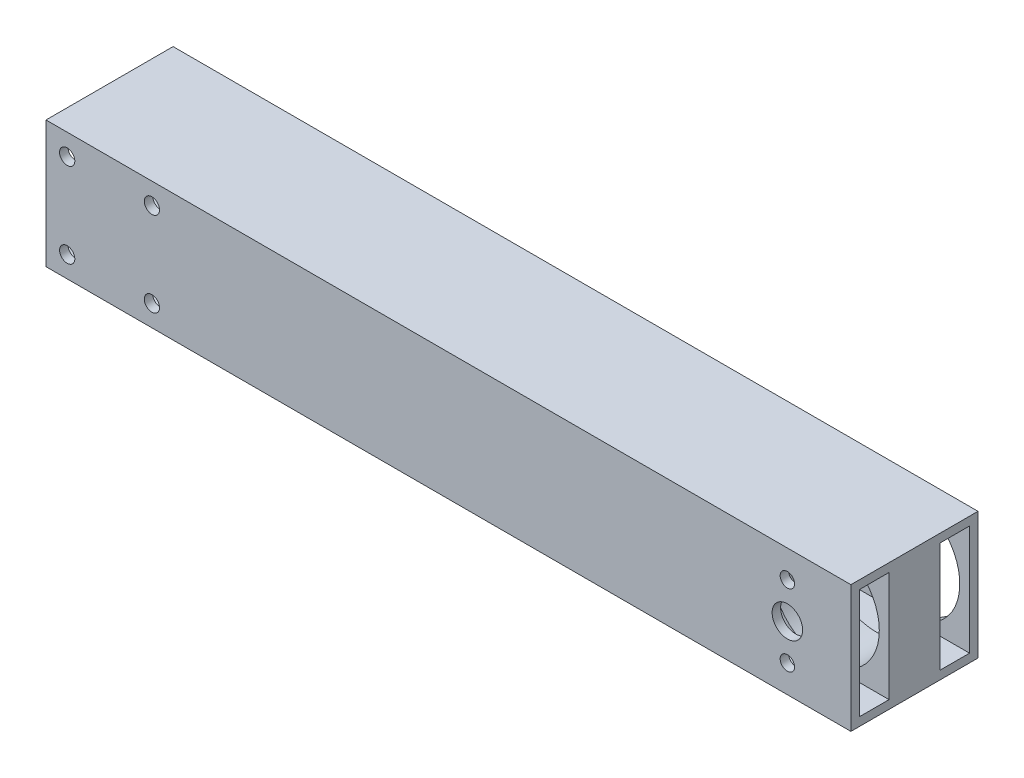
ISO-10303-21;
HEADER;
FILE_DESCRIPTION(('STEP AP214'),'2;1');
FILE_NAME('part.step','',(''),(''),'','','');
FILE_SCHEMA(('AUTOMOTIVE_DESIGN { 1 0 10303 214 1 1 1 1 }'));
ENDSEC;
DATA;
#1=APPLICATION_CONTEXT('core data for automotive mechanical design processes');
#2=APPLICATION_PROTOCOL_DEFINITION('international standard','automotive_design',2000,#1);
#3=PRODUCT_CONTEXT('',#1,'mechanical');
#4=PRODUCT('Part','Part','',(#3));
#5=PRODUCT_RELATED_PRODUCT_CATEGORY('part','',(#4));
#6=PRODUCT_DEFINITION_FORMATION('','',#4);
#7=PRODUCT_DEFINITION_CONTEXT('part definition',#1,'design');
#8=PRODUCT_DEFINITION('design','',#6,#7);
#9=PRODUCT_DEFINITION_SHAPE('','',#8);
#10=(LENGTH_UNIT() NAMED_UNIT(*) SI_UNIT(.MILLI.,.METRE.));
#11=(NAMED_UNIT(*) PLANE_ANGLE_UNIT() SI_UNIT($,.RADIAN.));
#12=(NAMED_UNIT(*) SI_UNIT($,.STERADIAN.) SOLID_ANGLE_UNIT());
#13=UNCERTAINTY_MEASURE_WITH_UNIT(LENGTH_MEASURE(1.E-05),#10,'distance_accuracy_value','');
#14=(GEOMETRIC_REPRESENTATION_CONTEXT(3) GLOBAL_UNCERTAINTY_ASSIGNED_CONTEXT((#13)) GLOBAL_UNIT_ASSIGNED_CONTEXT((#10,
#11,#12)) REPRESENTATION_CONTEXT('',''));
#15=CARTESIAN_POINT('',(0.,0.,0.));
#16=DIRECTION('',(0.,0.,1.));
#17=DIRECTION('',(1.,0.,0.));
#18=AXIS2_PLACEMENT_3D('',#15,#16,#17);
#19=CARTESIAN_POINT('',(-80.,13.,6.));
#20=DIRECTION('',(0.,0.,-1.));
#21=DIRECTION('',(0.,1.,0.));
#22=AXIS2_PLACEMENT_3D('',#19,#20,#21);
#23=PLANE('',#22);
#24=CARTESIAN_POINT('',(95.,0.,6.));
#25=DIRECTION('',(0.,0.,-1.));
#26=DIRECTION('',(0.,1.,0.));
#27=AXIS2_PLACEMENT_3D('',#24,#25,#26);
#28=CIRCLE('',#27,12.7);
#29=CARTESIAN_POINT('',(95.,12.7,6.));
#30=VERTEX_POINT('',#29);
#31=EDGE_CURVE('E264',#30,#30,#28,.T.);
#32=ORIENTED_EDGE('',*,*,#31,.T.);
#33=EDGE_LOOP('',(#32));
#34=FACE_BOUND('',#33,.T.);
#35=DIRECTION('',(0.,1.,0.));
#36=VECTOR('',#35,1.);
#37=CARTESIAN_POINT('',(75.,13.,6.));
#38=LINE('',#37,#36);
#39=CARTESIAN_POINT('',(75.,-13.,6.));
#40=VERTEX_POINT('',#39);
#41=CARTESIAN_POINT('',(75.,13.,6.));
#42=VERTEX_POINT('',#41);
#43=EDGE_CURVE('E141',#40,#42,#38,.T.);
#44=ORIENTED_EDGE('',*,*,#43,.F.);
#45=DIRECTION('',(1.,0.,0.));
#46=VECTOR('',#45,1.);
#47=CARTESIAN_POINT('',(-80.,-13.,6.));
#48=LINE('',#47,#46);
#49=CARTESIAN_POINT('',(110.,-13.,6.));
#50=VERTEX_POINT('',#49);
#51=EDGE_CURVE('E138',#40,#50,#48,.T.);
#52=ORIENTED_EDGE('',*,*,#51,.T.);
#53=DIRECTION('',(0.,1.,0.));
#54=VECTOR('',#53,1.);
#55=CARTESIAN_POINT('',(110.,13.,6.));
#56=LINE('',#55,#54);
#57=CARTESIAN_POINT('',(110.,13.,6.));
#58=VERTEX_POINT('',#57);
#59=EDGE_CURVE('E281',#50,#58,#56,.T.);
#60=ORIENTED_EDGE('',*,*,#59,.T.);
#61=DIRECTION('',(1.,0.,0.));
#62=VECTOR('',#61,1.);
#63=CARTESIAN_POINT('',(-80.,13.,6.));
#64=LINE('',#63,#62);
#65=EDGE_CURVE('E178',#42,#58,#64,.T.);
#66=ORIENTED_EDGE('',*,*,#65,.F.);
#67=EDGE_LOOP('',(#44,#52,#60,#66));
#68=FACE_BOUND('',#67,.T.);
#69=ADVANCED_FACE('F41',(#34,#68),#23,.F.);
#70=CARTESIAN_POINT('',(-80.,13.,-6.));
#71=DIRECTION('',(0.,0.,1.));
#72=DIRECTION('',(0.,-1.,0.));
#73=AXIS2_PLACEMENT_3D('',#70,#71,#72);
#74=PLANE('',#73);
#75=CARTESIAN_POINT('',(95.,0.,-6.));
#76=DIRECTION('',(0.,0.,1.));
#77=DIRECTION('',(0.,-1.,0.));
#78=AXIS2_PLACEMENT_3D('',#75,#76,#77);
#79=CIRCLE('',#78,12.7);
#80=CARTESIAN_POINT('',(95.,-12.7,-6.));
#81=VERTEX_POINT('',#80);
#82=EDGE_CURVE('E195',#81,#81,#79,.T.);
#83=ORIENTED_EDGE('',*,*,#82,.T.);
#84=EDGE_LOOP('',(#83));
#85=FACE_BOUND('',#84,.T.);
#86=DIRECTION('',(0.,-1.,0.));
#87=VECTOR('',#86,1.);
#88=CARTESIAN_POINT('',(75.,13.,-6.));
#89=LINE('',#88,#87);
#90=CARTESIAN_POINT('',(75.,13.,-6.));
#91=VERTEX_POINT('',#90);
#92=CARTESIAN_POINT('',(75.,-13.,-6.));
#93=VERTEX_POINT('',#92);
#94=EDGE_CURVE('E142',#91,#93,#89,.T.);
#95=ORIENTED_EDGE('',*,*,#94,.F.);
#96=DIRECTION('',(1.,0.,0.));
#97=VECTOR('',#96,1.);
#98=CARTESIAN_POINT('',(-80.,13.,-6.));
#99=LINE('',#98,#97);
#100=CARTESIAN_POINT('',(110.,13.,-6.));
#101=VERTEX_POINT('',#100);
#102=EDGE_CURVE('E157',#91,#101,#99,.T.);
#103=ORIENTED_EDGE('',*,*,#102,.T.);
#104=DIRECTION('',(0.,-1.,0.));
#105=VECTOR('',#104,1.);
#106=CARTESIAN_POINT('',(110.,13.,-6.));
#107=LINE('',#106,#105);
#108=CARTESIAN_POINT('',(110.,-13.,-6.));
#109=VERTEX_POINT('',#108);
#110=EDGE_CURVE('E154',#101,#109,#107,.T.);
#111=ORIENTED_EDGE('',*,*,#110,.T.);
#112=DIRECTION('',(1.,0.,0.));
#113=VECTOR('',#112,1.);
#114=CARTESIAN_POINT('',(-80.,-13.,-6.));
#115=LINE('',#114,#113);
#116=EDGE_CURVE('E135',#93,#109,#115,.T.);
#117=ORIENTED_EDGE('',*,*,#116,.F.);
#118=EDGE_LOOP('',(#95,#103,#111,#117));
#119=FACE_BOUND('',#118,.T.);
#120=ADVANCED_FACE('F152',(#85,#119),#74,.F.);
#121=CARTESIAN_POINT('',(-80.,-15.,-15.));
#122=DIRECTION('',(0.,0.,-1.));
#123=DIRECTION('',(-1.,0.,0.));
#124=AXIS2_PLACEMENT_3D('',#121,#122,#123);
#125=PLANE('',#124);
#126=CARTESIAN_POINT('',(-75.,-10.,-15.));
#127=DIRECTION('',(0.,0.,1.));
#128=DIRECTION('',(1.,0.,0.));
#129=AXIS2_PLACEMENT_3D('',#126,#127,#128);
#130=CIRCLE('',#129,1.8);
#131=CARTESIAN_POINT('',(-73.2,-10.,-15.));
#132=VERTEX_POINT('',#131);
#133=EDGE_CURVE('E377',#132,#132,#130,.T.);
#134=ORIENTED_EDGE('',*,*,#133,.T.);
#135=EDGE_LOOP('',(#134));
#136=FACE_BOUND('',#135,.T.);
#137=CARTESIAN_POINT('',(-55.,-10.,-15.));
#138=DIRECTION('',(0.,0.,1.));
#139=DIRECTION('',(1.,0.,0.));
#140=AXIS2_PLACEMENT_3D('',#137,#138,#139);
#141=CIRCLE('',#140,1.8);
#142=CARTESIAN_POINT('',(-53.2,-10.,-15.));
#143=VERTEX_POINT('',#142);
#144=EDGE_CURVE('E217',#143,#143,#141,.T.);
#145=ORIENTED_EDGE('',*,*,#144,.T.);
#146=EDGE_LOOP('',(#145));
#147=FACE_BOUND('',#146,.T.);
#148=CARTESIAN_POINT('',(-55.,9.99999999999997,-15.));
#149=DIRECTION('',(0.,0.,1.));
#150=DIRECTION('',(1.,0.,0.));
#151=AXIS2_PLACEMENT_3D('',#148,#149,#150);
#152=CIRCLE('',#151,1.8);
#153=CARTESIAN_POINT('',(-53.2,9.99999999999997,-15.));
#154=VERTEX_POINT('',#153);
#155=EDGE_CURVE('E213',#154,#154,#152,.T.);
#156=ORIENTED_EDGE('',*,*,#155,.T.);
#157=EDGE_LOOP('',(#156));
#158=FACE_BOUND('',#157,.T.);
#159=CARTESIAN_POINT('',(-75.,10.,-15.));
#160=DIRECTION('',(0.,0.,1.));
#161=DIRECTION('',(1.,0.,0.));
#162=AXIS2_PLACEMENT_3D('',#159,#160,#161);
#163=CIRCLE('',#162,1.8);
#164=CARTESIAN_POINT('',(-73.2,10.,-15.));
#165=VERTEX_POINT('',#164);
#166=EDGE_CURVE('E242',#165,#165,#163,.T.);
#167=ORIENTED_EDGE('',*,*,#166,.T.);
#168=EDGE_LOOP('',(#167));
#169=FACE_BOUND('',#168,.T.);
#170=CARTESIAN_POINT('',(95.,0.,-15.));
#171=DIRECTION('',(0.,0.,-1.));
#172=DIRECTION('',(-1.,0.,0.));
#173=AXIS2_PLACEMENT_3D('',#170,#171,#172);
#174=CIRCLE('',#173,12.7);
#175=CARTESIAN_POINT('',(82.3,0.,-15.));
#176=VERTEX_POINT('',#175);
#177=EDGE_CURVE('E199',#176,#176,#174,.T.);
#178=ORIENTED_EDGE('',*,*,#177,.F.);
#179=EDGE_LOOP('',(#178));
#180=FACE_BOUND('',#179,.T.);
#181=DIRECTION('',(1.,0.,0.));
#182=VECTOR('',#181,1.);
#183=CARTESIAN_POINT('',(-80.,15.,-15.));
#184=LINE('',#183,#182);
#185=CARTESIAN_POINT('',(-80.,15.,-15.));
#186=VERTEX_POINT('',#185);
#187=CARTESIAN_POINT('',(110.,15.,-15.));
#188=VERTEX_POINT('',#187);
#189=EDGE_CURVE('E189',#186,#188,#184,.T.);
#190=ORIENTED_EDGE('',*,*,#189,.T.);
#191=DIRECTION('',(0.,1.,0.));
#192=VECTOR('',#191,1.);
#193=CARTESIAN_POINT('',(110.,-15.,-15.));
#194=LINE('',#193,#192);
#195=CARTESIAN_POINT('',(110.,-15.,-15.));
#196=VERTEX_POINT('',#195);
#197=EDGE_CURVE('E287',#196,#188,#194,.T.);
#198=ORIENTED_EDGE('',*,*,#197,.F.);
#199=DIRECTION('',(1.,0.,0.));
#200=VECTOR('',#199,1.);
#201=CARTESIAN_POINT('',(-80.,-15.,-15.));
#202=LINE('',#201,#200);
#203=CARTESIAN_POINT('',(-80.,-15.,-15.));
#204=VERTEX_POINT('',#203);
#205=EDGE_CURVE('E11',#204,#196,#202,.T.);
#206=ORIENTED_EDGE('',*,*,#205,.F.);
#207=DIRECTION('',(0.,1.,0.));
#208=VECTOR('',#207,1.);
#209=CARTESIAN_POINT('',(-80.,-15.,-15.));
#210=LINE('',#209,#208);
#211=EDGE_CURVE('E177',#204,#186,#210,.T.);
#212=ORIENTED_EDGE('',*,*,#211,.T.);
#213=EDGE_LOOP('',(#190,#198,#206,#212));
#214=FACE_BOUND('',#213,.T.);
#215=ADVANCED_FACE('F43',(#136,#147,#158,#169,#180,#214),#125,.T.);
#216=CARTESIAN_POINT('',(-80.,-15.,15.));
#217=DIRECTION('',(0.,-1.,0.));
#218=DIRECTION('',(0.,0.,-1.));
#219=AXIS2_PLACEMENT_3D('',#216,#217,#218);
#220=PLANE('',#219);
#221=ORIENTED_EDGE('',*,*,#205,.T.);
#222=DIRECTION('',(0.,0.,-1.));
#223=VECTOR('',#222,1.);
#224=CARTESIAN_POINT('',(110.,-15.,15.));
#225=LINE('',#224,#223);
#226=CARTESIAN_POINT('',(110.,-15.,15.));
#227=VERTEX_POINT('',#226);
#228=EDGE_CURVE('E296',#227,#196,#225,.T.);
#229=ORIENTED_EDGE('',*,*,#228,.F.);
#230=DIRECTION('',(1.,0.,0.));
#231=VECTOR('',#230,1.);
#232=CARTESIAN_POINT('',(-80.,-15.,15.));
#233=LINE('',#232,#231);
#234=CARTESIAN_POINT('',(-80.,-15.,15.));
#235=VERTEX_POINT('',#234);
#236=EDGE_CURVE('E50',#235,#227,#233,.T.);
#237=ORIENTED_EDGE('',*,*,#236,.F.);
#238=DIRECTION('',(0.,0.,-1.));
#239=VECTOR('',#238,1.);
#240=CARTESIAN_POINT('',(-80.,-15.,15.));
#241=LINE('',#240,#239);
#242=EDGE_CURVE('E188',#235,#204,#241,.T.);
#243=ORIENTED_EDGE('',*,*,#242,.T.);
#244=EDGE_LOOP('',(#221,#229,#237,#243));
#245=FACE_BOUND('',#244,.T.);
#246=ADVANCED_FACE('F355',(#245),#220,.T.);
#247=CARTESIAN_POINT('',(-80.,-15.,15.));
#248=DIRECTION('',(0.,0.,1.));
#249=DIRECTION('',(1.,0.,0.));
#250=AXIS2_PLACEMENT_3D('',#247,#248,#249);
#251=PLANE('',#250);
#252=CARTESIAN_POINT('',(-75.,-10.,15.));
#253=DIRECTION('',(0.,0.,1.));
#254=DIRECTION('',(1.,0.,0.));
#255=AXIS2_PLACEMENT_3D('',#252,#253,#254);
#256=CIRCLE('',#255,1.8);
#257=CARTESIAN_POINT('',(-73.2,-10.,15.));
#258=VERTEX_POINT('',#257);
#259=EDGE_CURVE('E430',#258,#258,#256,.T.);
#260=ORIENTED_EDGE('',*,*,#259,.F.);
#261=EDGE_LOOP('',(#260));
#262=FACE_BOUND('',#261,.T.);
#263=CARTESIAN_POINT('',(-55.,-10.,15.));
#264=DIRECTION('',(0.,0.,1.));
#265=DIRECTION('',(1.,0.,0.));
#266=AXIS2_PLACEMENT_3D('',#263,#264,#265);
#267=CIRCLE('',#266,1.8);
#268=CARTESIAN_POINT('',(-53.2,-10.,15.));
#269=VERTEX_POINT('',#268);
#270=EDGE_CURVE('E224',#269,#269,#267,.T.);
#271=ORIENTED_EDGE('',*,*,#270,.F.);
#272=EDGE_LOOP('',(#271));
#273=FACE_BOUND('',#272,.T.);
#274=CARTESIAN_POINT('',(-55.,9.99999999999997,15.));
#275=DIRECTION('',(0.,0.,1.));
#276=DIRECTION('',(1.,0.,0.));
#277=AXIS2_PLACEMENT_3D('',#274,#275,#276);
#278=CIRCLE('',#277,1.8);
#279=CARTESIAN_POINT('',(-53.2,9.99999999999997,15.));
#280=VERTEX_POINT('',#279);
#281=EDGE_CURVE('E221',#280,#280,#278,.T.);
#282=ORIENTED_EDGE('',*,*,#281,.F.);
#283=EDGE_LOOP('',(#282));
#284=FACE_BOUND('',#283,.T.);
#285=CARTESIAN_POINT('',(-75.,10.,15.));
#286=DIRECTION('',(0.,0.,1.));
#287=DIRECTION('',(1.,0.,0.));
#288=AXIS2_PLACEMENT_3D('',#285,#286,#287);
#289=CIRCLE('',#288,1.8);
#290=CARTESIAN_POINT('',(-73.2,10.,15.));
#291=VERTEX_POINT('',#290);
#292=EDGE_CURVE('E239',#291,#291,#289,.T.);
#293=ORIENTED_EDGE('',*,*,#292,.F.);
#294=EDGE_LOOP('',(#293));
#295=FACE_BOUND('',#294,.T.);
#296=CARTESIAN_POINT('',(95.,-8.5,15.));
#297=DIRECTION('',(0.,0.,1.));
#298=DIRECTION('',(1.,0.,0.));
#299=AXIS2_PLACEMENT_3D('',#296,#297,#298);
#300=CIRCLE('',#299,1.7);
#301=CARTESIAN_POINT('',(96.7,-8.5,15.));
#302=VERTEX_POINT('',#301);
#303=EDGE_CURVE('E252',#302,#302,#300,.T.);
#304=ORIENTED_EDGE('',*,*,#303,.F.);
#305=EDGE_LOOP('',(#304));
#306=FACE_BOUND('',#305,.T.);
#307=CARTESIAN_POINT('',(95.,8.5,15.));
#308=DIRECTION('',(0.,0.,1.));
#309=DIRECTION('',(1.,0.,0.));
#310=AXIS2_PLACEMENT_3D('',#307,#308,#309);
#311=CIRCLE('',#310,1.7);
#312=CARTESIAN_POINT('',(96.7,8.5,15.));
#313=VERTEX_POINT('',#312);
#314=EDGE_CURVE('E253',#313,#313,#311,.T.);
#315=ORIENTED_EDGE('',*,*,#314,.F.);
#316=EDGE_LOOP('',(#315));
#317=FACE_BOUND('',#316,.T.);
#318=CARTESIAN_POINT('',(95.,0.,15.));
#319=DIRECTION('',(0.,0.,1.));
#320=DIRECTION('',(1.,0.,0.));
#321=AXIS2_PLACEMENT_3D('',#318,#319,#320);
#322=CIRCLE('',#321,3.6);
#323=CARTESIAN_POINT('',(98.6,0.,15.));
#324=VERTEX_POINT('',#323);
#325=EDGE_CURVE('E204',#324,#324,#322,.T.);
#326=ORIENTED_EDGE('',*,*,#325,.F.);
#327=EDGE_LOOP('',(#326));
#328=FACE_BOUND('',#327,.T.);
#329=ORIENTED_EDGE('',*,*,#236,.T.);
#330=DIRECTION('',(0.,-1.,0.));
#331=VECTOR('',#330,1.);
#332=CARTESIAN_POINT('',(110.,-15.,15.));
#333=LINE('',#332,#331);
#334=CARTESIAN_POINT('',(110.,15.,15.));
#335=VERTEX_POINT('',#334);
#336=EDGE_CURVE('E293',#335,#227,#333,.T.);
#337=ORIENTED_EDGE('',*,*,#336,.F.);
#338=DIRECTION('',(1.,0.,0.));
#339=VECTOR('',#338,1.);
#340=CARTESIAN_POINT('',(-80.,15.,15.));
#341=LINE('',#340,#339);
#342=CARTESIAN_POINT('',(-80.,15.,15.));
#343=VERTEX_POINT('',#342);
#344=EDGE_CURVE('E192',#343,#335,#341,.T.);
#345=ORIENTED_EDGE('',*,*,#344,.F.);
#346=DIRECTION('',(0.,-1.,0.));
#347=VECTOR('',#346,1.);
#348=CARTESIAN_POINT('',(-80.,-15.,15.));
#349=LINE('',#348,#347);
#350=EDGE_CURVE('E186',#343,#235,#349,.T.);
#351=ORIENTED_EDGE('',*,*,#350,.T.);
#352=EDGE_LOOP('',(#329,#337,#345,#351));
#353=FACE_BOUND('',#352,.T.);
#354=ADVANCED_FACE('F358',(#262,#273,#284,#295,#306,#317,#328,#353),#251,.T.);
#355=CARTESIAN_POINT('',(-80.,15.,15.));
#356=DIRECTION('',(0.,1.,0.));
#357=DIRECTION('',(0.,0.,1.));
#358=AXIS2_PLACEMENT_3D('',#355,#356,#357);
#359=PLANE('',#358);
#360=ORIENTED_EDGE('',*,*,#344,.T.);
#361=DIRECTION('',(0.,0.,1.));
#362=VECTOR('',#361,1.);
#363=CARTESIAN_POINT('',(110.,15.,15.));
#364=LINE('',#363,#362);
#365=EDGE_CURVE('E290',#188,#335,#364,.T.);
#366=ORIENTED_EDGE('',*,*,#365,.F.);
#367=ORIENTED_EDGE('',*,*,#189,.F.);
#368=DIRECTION('',(0.,0.,1.));
#369=VECTOR('',#368,1.);
#370=CARTESIAN_POINT('',(-80.,15.,15.));
#371=LINE('',#370,#369);
#372=EDGE_CURVE('E183',#186,#343,#371,.T.);
#373=ORIENTED_EDGE('',*,*,#372,.T.);
#374=EDGE_LOOP('',(#360,#366,#367,#373));
#375=FACE_BOUND('',#374,.T.);
#376=ADVANCED_FACE('F354',(#375),#359,.T.);
#377=CARTESIAN_POINT('',(-80.,0.,0.));
#378=DIRECTION('',(-1.,0.,0.));
#379=DIRECTION('',(0.,0.,1.));
#380=AXIS2_PLACEMENT_3D('',#377,#378,#379);
#381=PLANE('',#380);
#382=DIRECTION('',(0.,1.,0.));
#383=VECTOR('',#382,1.);
#384=CARTESIAN_POINT('',(-80.,13.,-13.));
#385=LINE('',#384,#383);
#386=CARTESIAN_POINT('',(-80.,-13.,-13.));
#387=VERTEX_POINT('',#386);
#388=CARTESIAN_POINT('',(-80.,13.,-13.));
#389=VERTEX_POINT('',#388);
#390=EDGE_CURVE('E166',#387,#389,#385,.T.);
#391=ORIENTED_EDGE('',*,*,#390,.T.);
#392=DIRECTION('',(0.,0.,1.));
#393=VECTOR('',#392,1.);
#394=CARTESIAN_POINT('',(-80.,13.,13.));
#395=LINE('',#394,#393);
#396=CARTESIAN_POINT('',(-80.,13.,13.));
#397=VERTEX_POINT('',#396);
#398=EDGE_CURVE('E171',#389,#397,#395,.T.);
#399=ORIENTED_EDGE('',*,*,#398,.T.);
#400=DIRECTION('',(0.,-1.,0.));
#401=VECTOR('',#400,1.);
#402=CARTESIAN_POINT('',(-80.,13.,13.));
#403=LINE('',#402,#401);
#404=CARTESIAN_POINT('',(-80.,-13.,13.));
#405=VERTEX_POINT('',#404);
#406=EDGE_CURVE('E159',#397,#405,#403,.T.);
#407=ORIENTED_EDGE('',*,*,#406,.T.);
#408=DIRECTION('',(0.,0.,-1.));
#409=VECTOR('',#408,1.);
#410=CARTESIAN_POINT('',(-80.,-13.,13.));
#411=LINE('',#410,#409);
#412=EDGE_CURVE('E169',#405,#387,#411,.T.);
#413=ORIENTED_EDGE('',*,*,#412,.T.);
#414=EDGE_LOOP('',(#391,#399,#407,#413));
#415=FACE_BOUND('',#414,.T.);
#416=ORIENTED_EDGE('',*,*,#211,.F.);
#417=ORIENTED_EDGE('',*,*,#242,.F.);
#418=ORIENTED_EDGE('',*,*,#350,.F.);
#419=ORIENTED_EDGE('',*,*,#372,.F.);
#420=EDGE_LOOP('',(#416,#417,#418,#419));
#421=FACE_BOUND('',#420,.T.);
#422=ADVANCED_FACE('F301',(#415,#421),#381,.T.);
#423=CARTESIAN_POINT('',(-80.,13.,13.));
#424=DIRECTION('',(0.,0.,1.));
#425=DIRECTION('',(0.,-1.,0.));
#426=AXIS2_PLACEMENT_3D('',#423,#424,#425);
#427=PLANE('',#426);
#428=CARTESIAN_POINT('',(-75.,-10.,13.));
#429=DIRECTION('',(0.,0.,1.));
#430=DIRECTION('',(0.,-1.,0.));
#431=AXIS2_PLACEMENT_3D('',#428,#429,#430);
#432=CIRCLE('',#431,1.8);
#433=CARTESIAN_POINT('',(-75.,-11.8,13.));
#434=VERTEX_POINT('',#433);
#435=EDGE_CURVE('E229',#434,#434,#432,.T.);
#436=ORIENTED_EDGE('',*,*,#435,.T.);
#437=EDGE_LOOP('',(#436));
#438=FACE_BOUND('',#437,.T.);
#439=CARTESIAN_POINT('',(-55.,-10.,13.));
#440=DIRECTION('',(0.,0.,1.));
#441=DIRECTION('',(0.,-1.,0.));
#442=AXIS2_PLACEMENT_3D('',#439,#440,#441);
#443=CIRCLE('',#442,1.8);
#444=CARTESIAN_POINT('',(-55.,-11.8,13.));
#445=VERTEX_POINT('',#444);
#446=EDGE_CURVE('E216',#445,#445,#443,.T.);
#447=ORIENTED_EDGE('',*,*,#446,.T.);
#448=EDGE_LOOP('',(#447));
#449=FACE_BOUND('',#448,.T.);
#450=CARTESIAN_POINT('',(-55.,9.99999999999997,13.));
#451=DIRECTION('',(0.,0.,1.));
#452=DIRECTION('',(0.,-1.,0.));
#453=AXIS2_PLACEMENT_3D('',#450,#451,#452);
#454=CIRCLE('',#453,1.8);
#455=CARTESIAN_POINT('',(-55.,8.19999999999997,13.));
#456=VERTEX_POINT('',#455);
#457=EDGE_CURVE('E212',#456,#456,#454,.T.);
#458=ORIENTED_EDGE('',*,*,#457,.T.);
#459=EDGE_LOOP('',(#458));
#460=FACE_BOUND('',#459,.T.);
#461=CARTESIAN_POINT('',(-75.,10.,13.));
#462=DIRECTION('',(0.,0.,1.));
#463=DIRECTION('',(0.,-1.,0.));
#464=AXIS2_PLACEMENT_3D('',#461,#462,#463);
#465=CIRCLE('',#464,1.8);
#466=CARTESIAN_POINT('',(-75.,8.2,13.));
#467=VERTEX_POINT('',#466);
#468=EDGE_CURVE('E150',#467,#467,#465,.T.);
#469=ORIENTED_EDGE('',*,*,#468,.T.);
#470=EDGE_LOOP('',(#469));
#471=FACE_BOUND('',#470,.T.);
#472=CARTESIAN_POINT('',(95.,-8.5,13.));
#473=DIRECTION('',(0.,0.,1.));
#474=DIRECTION('',(0.,-1.,0.));
#475=AXIS2_PLACEMENT_3D('',#472,#473,#474);
#476=CIRCLE('',#475,1.7);
#477=CARTESIAN_POINT('',(95.,-10.2,13.));
#478=VERTEX_POINT('',#477);
#479=EDGE_CURVE('E207',#478,#478,#476,.T.);
#480=ORIENTED_EDGE('',*,*,#479,.T.);
#481=EDGE_LOOP('',(#480));
#482=FACE_BOUND('',#481,.T.);
#483=CARTESIAN_POINT('',(95.,8.5,13.));
#484=DIRECTION('',(0.,0.,1.));
#485=DIRECTION('',(0.,-1.,0.));
#486=AXIS2_PLACEMENT_3D('',#483,#484,#485);
#487=CIRCLE('',#486,1.7);
#488=CARTESIAN_POINT('',(95.,6.8,13.));
#489=VERTEX_POINT('',#488);
#490=EDGE_CURVE('E203',#489,#489,#487,.T.);
#491=ORIENTED_EDGE('',*,*,#490,.T.);
#492=EDGE_LOOP('',(#491));
#493=FACE_BOUND('',#492,.T.);
#494=CARTESIAN_POINT('',(95.,0.,13.));
#495=DIRECTION('',(0.,0.,1.));
#496=DIRECTION('',(0.,-1.,0.));
#497=AXIS2_PLACEMENT_3D('',#494,#495,#496);
#498=CIRCLE('',#497,3.6);
#499=CARTESIAN_POINT('',(95.,-3.6,13.));
#500=VERTEX_POINT('',#499);
#501=EDGE_CURVE('E200',#500,#500,#498,.T.);
#502=ORIENTED_EDGE('',*,*,#501,.T.);
#503=EDGE_LOOP('',(#502));
#504=FACE_BOUND('',#503,.T.);
#505=DIRECTION('',(1.,0.,0.));
#506=VECTOR('',#505,1.);
#507=CARTESIAN_POINT('',(-80.,13.,13.));
#508=LINE('',#507,#506);
#509=CARTESIAN_POINT('',(110.,13.,13.));
#510=VERTEX_POINT('',#509);
#511=EDGE_CURVE('E175',#397,#510,#508,.T.);
#512=ORIENTED_EDGE('',*,*,#511,.T.);
#513=DIRECTION('',(0.,-1.,0.));
#514=VECTOR('',#513,1.);
#515=CARTESIAN_POINT('',(110.,13.,13.));
#516=LINE('',#515,#514);
#517=CARTESIAN_POINT('',(110.,-13.,13.));
#518=VERTEX_POINT('',#517);
#519=EDGE_CURVE('E276',#510,#518,#516,.T.);
#520=ORIENTED_EDGE('',*,*,#519,.T.);
#521=DIRECTION('',(1.,0.,0.));
#522=VECTOR('',#521,1.);
#523=CARTESIAN_POINT('',(-80.,-13.,13.));
#524=LINE('',#523,#522);
#525=EDGE_CURVE('E174',#405,#518,#524,.T.);
#526=ORIENTED_EDGE('',*,*,#525,.F.);
#527=ORIENTED_EDGE('',*,*,#406,.F.);
#528=EDGE_LOOP('',(#512,#520,#526,#527));
#529=FACE_BOUND('',#528,.T.);
#530=ADVANCED_FACE('F316',(#438,#449,#460,#471,#482,#493,#504,#529),#427,.F.);
#531=CARTESIAN_POINT('',(-80.,13.,13.));
#532=DIRECTION('',(0.,1.,0.));
#533=DIRECTION('',(0.,0.,1.));
#534=AXIS2_PLACEMENT_3D('',#531,#532,#533);
#535=PLANE('',#534);
#536=ORIENTED_EDGE('',*,*,#398,.F.);
#537=DIRECTION('',(1.,0.,0.));
#538=VECTOR('',#537,1.);
#539=CARTESIAN_POINT('',(-80.,13.,-13.));
#540=LINE('',#539,#538);
#541=CARTESIAN_POINT('',(110.,13.,-13.));
#542=VERTEX_POINT('',#541);
#543=EDGE_CURVE('E161',#389,#542,#540,.T.);
#544=ORIENTED_EDGE('',*,*,#543,.T.);
#545=DIRECTION('',(0.,0.,1.));
#546=VECTOR('',#545,1.);
#547=CARTESIAN_POINT('',(110.,13.,-13.));
#548=LINE('',#547,#546);
#549=EDGE_CURVE('E270',#542,#101,#548,.T.);
#550=ORIENTED_EDGE('',*,*,#549,.T.);
#551=ORIENTED_EDGE('',*,*,#102,.F.);
#552=DIRECTION('',(0.,0.,-1.));
#553=VECTOR('',#552,1.);
#554=CARTESIAN_POINT('',(75.,13.,-6.));
#555=LINE('',#554,#553);
#556=EDGE_CURVE('E147',#42,#91,#555,.T.);
#557=ORIENTED_EDGE('',*,*,#556,.F.);
#558=ORIENTED_EDGE('',*,*,#65,.T.);
#559=DIRECTION('',(0.,0.,1.));
#560=VECTOR('',#559,1.);
#561=CARTESIAN_POINT('',(110.,13.,13.));
#562=LINE('',#561,#560);
#563=EDGE_CURVE('E284',#58,#510,#562,.T.);
#564=ORIENTED_EDGE('',*,*,#563,.T.);
#565=ORIENTED_EDGE('',*,*,#511,.F.);
#566=EDGE_LOOP('',(#536,#544,#550,#551,#557,#558,#564,#565));
#567=FACE_BOUND('',#566,.T.);
#568=ADVANCED_FACE('F311',(#567),#535,.F.);
#569=CARTESIAN_POINT('',(-80.,-13.,13.));
#570=DIRECTION('',(0.,-1.,0.));
#571=DIRECTION('',(0.,0.,-1.));
#572=AXIS2_PLACEMENT_3D('',#569,#570,#571);
#573=PLANE('',#572);
#574=ORIENTED_EDGE('',*,*,#525,.T.);
#575=DIRECTION('',(0.,0.,-1.));
#576=VECTOR('',#575,1.);
#577=CARTESIAN_POINT('',(110.,-13.,13.));
#578=LINE('',#577,#576);
#579=EDGE_CURVE('E279',#518,#50,#578,.T.);
#580=ORIENTED_EDGE('',*,*,#579,.T.);
#581=ORIENTED_EDGE('',*,*,#51,.F.);
#582=DIRECTION('',(0.,0.,1.));
#583=VECTOR('',#582,1.);
#584=CARTESIAN_POINT('',(75.,-13.,-6.));
#585=LINE('',#584,#583);
#586=EDGE_CURVE('E130',#93,#40,#585,.T.);
#587=ORIENTED_EDGE('',*,*,#586,.F.);
#588=ORIENTED_EDGE('',*,*,#116,.T.);
#589=DIRECTION('',(0.,0.,-1.));
#590=VECTOR('',#589,1.);
#591=CARTESIAN_POINT('',(110.,-13.,-13.));
#592=LINE('',#591,#590);
#593=CARTESIAN_POINT('',(110.,-13.,-13.));
#594=VERTEX_POINT('',#593);
#595=EDGE_CURVE('E274',#109,#594,#592,.T.);
#596=ORIENTED_EDGE('',*,*,#595,.T.);
#597=DIRECTION('',(1.,0.,0.));
#598=VECTOR('',#597,1.);
#599=CARTESIAN_POINT('',(-80.,-13.,-13.));
#600=LINE('',#599,#598);
#601=EDGE_CURVE('E156',#387,#594,#600,.T.);
#602=ORIENTED_EDGE('',*,*,#601,.F.);
#603=ORIENTED_EDGE('',*,*,#412,.F.);
#604=EDGE_LOOP('',(#574,#580,#581,#587,#588,#596,#602,#603));
#605=FACE_BOUND('',#604,.T.);
#606=ADVANCED_FACE('F132',(#605),#573,.F.);
#607=CARTESIAN_POINT('',(-80.,13.,-13.));
#608=DIRECTION('',(0.,0.,-1.));
#609=DIRECTION('',(0.,1.,0.));
#610=AXIS2_PLACEMENT_3D('',#607,#608,#609);
#611=PLANE('',#610);
#612=CARTESIAN_POINT('',(-75.,-10.,-13.));
#613=DIRECTION('',(0.,0.,-1.));
#614=DIRECTION('',(0.,1.,0.));
#615=AXIS2_PLACEMENT_3D('',#612,#613,#614);
#616=CIRCLE('',#615,1.8);
#617=CARTESIAN_POINT('',(-75.,-8.20000000000001,-13.));
#618=VERTEX_POINT('',#617);
#619=EDGE_CURVE('E45',#618,#618,#616,.T.);
#620=ORIENTED_EDGE('',*,*,#619,.T.);
#621=EDGE_LOOP('',(#620));
#622=FACE_BOUND('',#621,.T.);
#623=CARTESIAN_POINT('',(-55.,-10.,-13.));
#624=DIRECTION('',(0.,0.,-1.));
#625=DIRECTION('',(0.,1.,0.));
#626=AXIS2_PLACEMENT_3D('',#623,#624,#625);
#627=CIRCLE('',#626,1.8);
#628=CARTESIAN_POINT('',(-55.,-8.20000000000002,-13.));
#629=VERTEX_POINT('',#628);
#630=EDGE_CURVE('E214',#629,#629,#627,.T.);
#631=ORIENTED_EDGE('',*,*,#630,.T.);
#632=EDGE_LOOP('',(#631));
#633=FACE_BOUND('',#632,.T.);
#634=CARTESIAN_POINT('',(-55.,9.99999999999997,-13.));
#635=DIRECTION('',(0.,0.,-1.));
#636=DIRECTION('',(0.,1.,0.));
#637=AXIS2_PLACEMENT_3D('',#634,#635,#636);
#638=CIRCLE('',#637,1.8);
#639=CARTESIAN_POINT('',(-55.,11.8,-13.));
#640=VERTEX_POINT('',#639);
#641=EDGE_CURVE('E210',#640,#640,#638,.T.);
#642=ORIENTED_EDGE('',*,*,#641,.T.);
#643=EDGE_LOOP('',(#642));
#644=FACE_BOUND('',#643,.T.);
#645=CARTESIAN_POINT('',(-75.,10.,-13.));
#646=DIRECTION('',(0.,0.,-1.));
#647=DIRECTION('',(0.,1.,0.));
#648=AXIS2_PLACEMENT_3D('',#645,#646,#647);
#649=CIRCLE('',#648,1.8);
#650=CARTESIAN_POINT('',(-75.,11.8,-13.));
#651=VERTEX_POINT('',#650);
#652=EDGE_CURVE('E245',#651,#651,#649,.T.);
#653=ORIENTED_EDGE('',*,*,#652,.T.);
#654=EDGE_LOOP('',(#653));
#655=FACE_BOUND('',#654,.T.);
#656=CARTESIAN_POINT('',(95.,0.,-13.));
#657=DIRECTION('',(0.,0.,-1.));
#658=DIRECTION('',(0.,1.,0.));
#659=AXIS2_PLACEMENT_3D('',#656,#657,#658);
#660=CIRCLE('',#659,12.7);
#661=CARTESIAN_POINT('',(95.,12.7,-13.));
#662=VERTEX_POINT('',#661);
#663=EDGE_CURVE('E198',#662,#662,#660,.T.);
#664=ORIENTED_EDGE('',*,*,#663,.T.);
#665=EDGE_LOOP('',(#664));
#666=FACE_BOUND('',#665,.T.);
#667=ORIENTED_EDGE('',*,*,#601,.T.);
#668=DIRECTION('',(0.,1.,0.));
#669=VECTOR('',#668,1.);
#670=CARTESIAN_POINT('',(110.,13.,-13.));
#671=LINE('',#670,#669);
#672=EDGE_CURVE('E267',#594,#542,#671,.T.);
#673=ORIENTED_EDGE('',*,*,#672,.T.);
#674=ORIENTED_EDGE('',*,*,#543,.F.);
#675=ORIENTED_EDGE('',*,*,#390,.F.);
#676=EDGE_LOOP('',(#667,#673,#674,#675));
#677=FACE_BOUND('',#676,.T.);
#678=ADVANCED_FACE('F307',(#622,#633,#644,#655,#666,#677),#611,.F.);
#679=CARTESIAN_POINT('',(110.,0.,0.));
#680=DIRECTION('',(-1.,0.,0.));
#681=DIRECTION('',(0.,0.,1.));
#682=AXIS2_PLACEMENT_3D('',#679,#680,#681);
#683=PLANE('',#682);
#684=ORIENTED_EDGE('',*,*,#519,.F.);
#685=ORIENTED_EDGE('',*,*,#563,.F.);
#686=ORIENTED_EDGE('',*,*,#59,.F.);
#687=ORIENTED_EDGE('',*,*,#579,.F.);
#688=EDGE_LOOP('',(#684,#685,#686,#687));
#689=FACE_BOUND('',#688,.T.);
#690=ORIENTED_EDGE('',*,*,#197,.T.);
#691=ORIENTED_EDGE('',*,*,#365,.T.);
#692=ORIENTED_EDGE('',*,*,#336,.T.);
#693=ORIENTED_EDGE('',*,*,#228,.T.);
#694=EDGE_LOOP('',(#690,#691,#692,#693));
#695=FACE_BOUND('',#694,.T.);
#696=ORIENTED_EDGE('',*,*,#672,.F.);
#697=ORIENTED_EDGE('',*,*,#595,.F.);
#698=ORIENTED_EDGE('',*,*,#110,.F.);
#699=ORIENTED_EDGE('',*,*,#549,.F.);
#700=EDGE_LOOP('',(#696,#697,#698,#699));
#701=FACE_BOUND('',#700,.T.);
#702=ADVANCED_FACE('F319',(#689,#695,#701),#683,.F.);
#703=CARTESIAN_POINT('',(95.,0.,8.00000000000004));
#704=DIRECTION('',(0.,0.,-1.));
#705=DIRECTION('',(-1.,0.,0.));
#706=AXIS2_PLACEMENT_3D('',#703,#704,#705);
#707=CYLINDRICAL_SURFACE('',#706,12.7);
#708=ORIENTED_EDGE('',*,*,#82,.F.);
#709=EDGE_LOOP('',(#708));
#710=FACE_BOUND('',#709,.T.);
#711=ORIENTED_EDGE('',*,*,#31,.F.);
#712=EDGE_LOOP('',(#711));
#713=FACE_BOUND('',#712,.T.);
#714=ADVANCED_FACE('F321',(#710,#713),#707,.F.);
#715=ORIENTED_EDGE('',*,*,#177,.T.);
#716=EDGE_LOOP('',(#715));
#717=FACE_BOUND('',#716,.T.);
#718=ORIENTED_EDGE('',*,*,#663,.F.);
#719=EDGE_LOOP('',(#718));
#720=FACE_BOUND('',#719,.T.);
#721=ADVANCED_FACE('F328',(#717,#720),#707,.F.);
#722=CARTESIAN_POINT('',(95.,0.,-2.00000000000003));
#723=DIRECTION('',(0.,0.,1.));
#724=DIRECTION('',(1.,0.,0.));
#725=AXIS2_PLACEMENT_3D('',#722,#723,#724);
#726=CYLINDRICAL_SURFACE('',#725,3.6);
#727=ORIENTED_EDGE('',*,*,#325,.T.);
#728=EDGE_LOOP('',(#727));
#729=FACE_BOUND('',#728,.T.);
#730=ORIENTED_EDGE('',*,*,#501,.F.);
#731=EDGE_LOOP('',(#730));
#732=FACE_BOUND('',#731,.T.);
#733=ADVANCED_FACE('F387',(#729,#732),#726,.F.);
#734=CARTESIAN_POINT('',(95.,8.5,-2.00000000000003));
#735=DIRECTION('',(0.,0.,1.));
#736=DIRECTION('',(1.,0.,0.));
#737=AXIS2_PLACEMENT_3D('',#734,#735,#736);
#738=CYLINDRICAL_SURFACE('',#737,1.7);
#739=ORIENTED_EDGE('',*,*,#314,.T.);
#740=EDGE_LOOP('',(#739));
#741=FACE_BOUND('',#740,.T.);
#742=ORIENTED_EDGE('',*,*,#490,.F.);
#743=EDGE_LOOP('',(#742));
#744=FACE_BOUND('',#743,.T.);
#745=ADVANCED_FACE('F393',(#741,#744),#738,.F.);
#746=CARTESIAN_POINT('',(95.,-8.5,-2.00000000000003));
#747=DIRECTION('',(0.,0.,1.));
#748=DIRECTION('',(1.,0.,0.));
#749=AXIS2_PLACEMENT_3D('',#746,#747,#748);
#750=CYLINDRICAL_SURFACE('',#749,1.7);
#751=ORIENTED_EDGE('',*,*,#303,.T.);
#752=EDGE_LOOP('',(#751));
#753=FACE_BOUND('',#752,.T.);
#754=ORIENTED_EDGE('',*,*,#479,.F.);
#755=EDGE_LOOP('',(#754));
#756=FACE_BOUND('',#755,.T.);
#757=ADVANCED_FACE('F397',(#753,#756),#750,.F.);
#758=CARTESIAN_POINT('',(75.,0.,0.));
#759=DIRECTION('',(-1.,0.,0.));
#760=DIRECTION('',(0.,0.,1.));
#761=AXIS2_PLACEMENT_3D('',#758,#759,#760);
#762=PLANE('',#761);
#763=ORIENTED_EDGE('',*,*,#94,.T.);
#764=ORIENTED_EDGE('',*,*,#586,.T.);
#765=ORIENTED_EDGE('',*,*,#43,.T.);
#766=ORIENTED_EDGE('',*,*,#556,.T.);
#767=EDGE_LOOP('',(#763,#764,#765,#766));
#768=FACE_BOUND('',#767,.T.);
#769=ADVANCED_FACE('F145',(#768),#762,.T.);
#770=CARTESIAN_POINT('',(-75.,10.,15.));
#771=DIRECTION('',(0.,0.,1.));
#772=DIRECTION('',(1.,0.,0.));
#773=AXIS2_PLACEMENT_3D('',#770,#771,#772);
#774=CYLINDRICAL_SURFACE('',#773,1.8);
#775=ORIENTED_EDGE('',*,*,#292,.T.);
#776=EDGE_LOOP('',(#775));
#777=FACE_BOUND('',#776,.T.);
#778=ORIENTED_EDGE('',*,*,#468,.F.);
#779=EDGE_LOOP('',(#778));
#780=FACE_BOUND('',#779,.T.);
#781=ADVANCED_FACE('F404',(#777,#780),#774,.F.);
#782=ORIENTED_EDGE('',*,*,#166,.F.);
#783=EDGE_LOOP('',(#782));
#784=FACE_BOUND('',#783,.T.);
#785=ORIENTED_EDGE('',*,*,#652,.F.);
#786=EDGE_LOOP('',(#785));
#787=FACE_BOUND('',#786,.T.);
#788=ADVANCED_FACE('F407',(#784,#787),#774,.F.);
#789=CARTESIAN_POINT('',(-55.,9.99999999999997,15.));
#790=DIRECTION('',(0.,0.,1.));
#791=DIRECTION('',(1.,0.,0.));
#792=AXIS2_PLACEMENT_3D('',#789,#790,#791);
#793=CYLINDRICAL_SURFACE('',#792,1.8);
#794=ORIENTED_EDGE('',*,*,#155,.F.);
#795=EDGE_LOOP('',(#794));
#796=FACE_BOUND('',#795,.T.);
#797=ORIENTED_EDGE('',*,*,#641,.F.);
#798=EDGE_LOOP('',(#797));
#799=FACE_BOUND('',#798,.T.);
#800=ADVANCED_FACE('F413',(#796,#799),#793,.F.);
#801=ORIENTED_EDGE('',*,*,#281,.T.);
#802=EDGE_LOOP('',(#801));
#803=FACE_BOUND('',#802,.T.);
#804=ORIENTED_EDGE('',*,*,#457,.F.);
#805=EDGE_LOOP('',(#804));
#806=FACE_BOUND('',#805,.T.);
#807=ADVANCED_FACE('F409',(#803,#806),#793,.F.);
#808=CARTESIAN_POINT('',(-55.,-10.,15.));
#809=DIRECTION('',(0.,0.,1.));
#810=DIRECTION('',(1.,0.,0.));
#811=AXIS2_PLACEMENT_3D('',#808,#809,#810);
#812=CYLINDRICAL_SURFACE('',#811,1.8);
#813=ORIENTED_EDGE('',*,*,#144,.F.);
#814=EDGE_LOOP('',(#813));
#815=FACE_BOUND('',#814,.T.);
#816=ORIENTED_EDGE('',*,*,#630,.F.);
#817=EDGE_LOOP('',(#816));
#818=FACE_BOUND('',#817,.T.);
#819=ADVANCED_FACE('F412',(#815,#818),#812,.F.);
#820=ORIENTED_EDGE('',*,*,#270,.T.);
#821=EDGE_LOOP('',(#820));
#822=FACE_BOUND('',#821,.T.);
#823=ORIENTED_EDGE('',*,*,#446,.F.);
#824=EDGE_LOOP('',(#823));
#825=FACE_BOUND('',#824,.T.);
#826=ADVANCED_FACE('F415',(#822,#825),#812,.F.);
#827=CARTESIAN_POINT('',(-75.,-10.,15.));
#828=DIRECTION('',(0.,0.,1.));
#829=DIRECTION('',(1.,0.,0.));
#830=AXIS2_PLACEMENT_3D('',#827,#828,#829);
#831=CYLINDRICAL_SURFACE('',#830,1.8);
#832=ORIENTED_EDGE('',*,*,#133,.F.);
#833=EDGE_LOOP('',(#832));
#834=FACE_BOUND('',#833,.T.);
#835=ORIENTED_EDGE('',*,*,#619,.F.);
#836=EDGE_LOOP('',(#835));
#837=FACE_BOUND('',#836,.T.);
#838=ADVANCED_FACE('F418',(#834,#837),#831,.F.);
#839=ORIENTED_EDGE('',*,*,#259,.T.);
#840=EDGE_LOOP('',(#839));
#841=FACE_BOUND('',#840,.T.);
#842=ORIENTED_EDGE('',*,*,#435,.F.);
#843=EDGE_LOOP('',(#842));
#844=FACE_BOUND('',#843,.T.);
#845=ADVANCED_FACE('F420',(#841,#844),#831,.F.);
#846=CLOSED_SHELL('',(#69,#120,#215,#246,#354,#376,#422,#530,#568,#606,#678,#702,#714,#721,#733,
#745,#757,#769,#781,#788,#800,#807,#819,#826,#838,#845));
#847=MANIFOLD_SOLID_BREP('B2',#846);
#848=ADVANCED_BREP_SHAPE_REPRESENTATION('',(#18,#847),#14);
#849=SHAPE_DEFINITION_REPRESENTATION(#9,#848);
ENDSEC;
END-ISO-10303-21;
